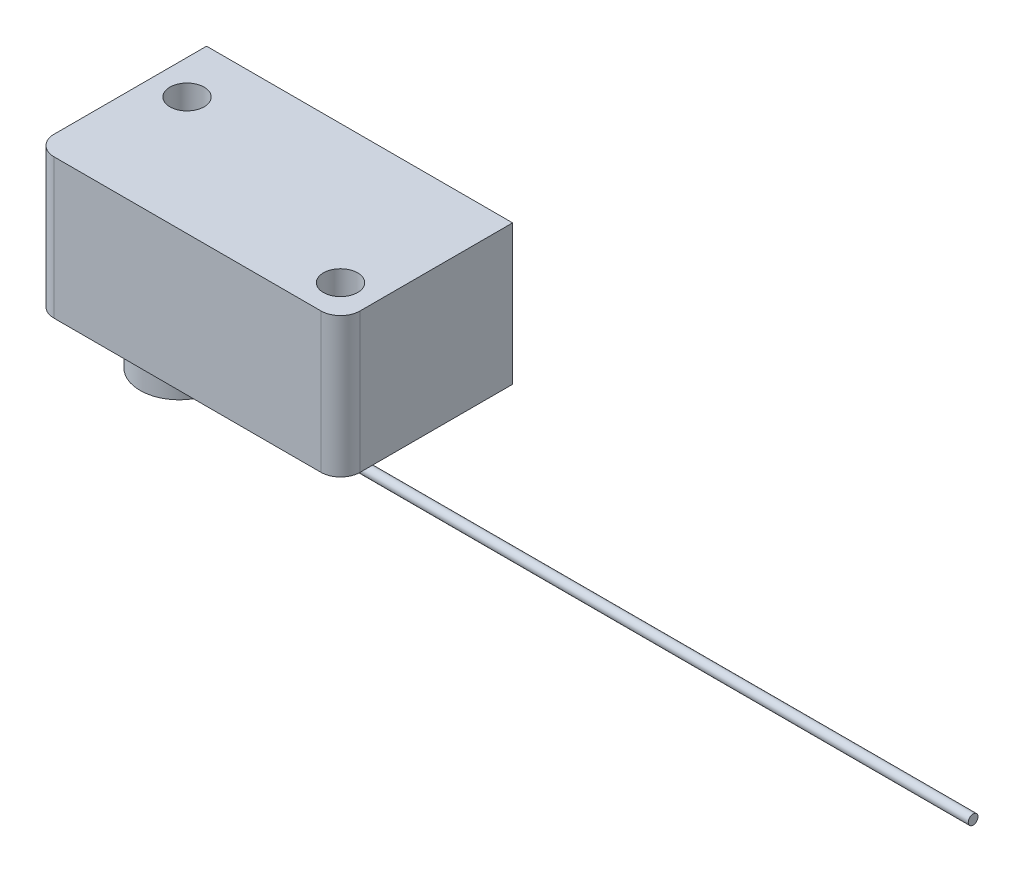
ISO-10303-21;
HEADER;
FILE_DESCRIPTION(('STEP AP214'),'2;1');
FILE_NAME('part.step','',(''),(''),'','','');
FILE_SCHEMA(('AUTOMOTIVE_DESIGN { 1 0 10303 214 1 1 1 1 }'));
ENDSEC;
DATA;
#1=APPLICATION_CONTEXT('core data for automotive mechanical design processes');
#2=APPLICATION_PROTOCOL_DEFINITION('international standard','automotive_design',2000,#1);
#3=PRODUCT_CONTEXT('',#1,'mechanical');
#4=PRODUCT('Part','Part','',(#3));
#5=PRODUCT_RELATED_PRODUCT_CATEGORY('part','',(#4));
#6=PRODUCT_DEFINITION_FORMATION('','',#4);
#7=PRODUCT_DEFINITION_CONTEXT('part definition',#1,'design');
#8=PRODUCT_DEFINITION('design','',#6,#7);
#9=PRODUCT_DEFINITION_SHAPE('','',#8);
#10=(LENGTH_UNIT() NAMED_UNIT(*) SI_UNIT(.MILLI.,.METRE.));
#11=(NAMED_UNIT(*) PLANE_ANGLE_UNIT() SI_UNIT($,.RADIAN.));
#12=(NAMED_UNIT(*) SI_UNIT($,.STERADIAN.) SOLID_ANGLE_UNIT());
#13=UNCERTAINTY_MEASURE_WITH_UNIT(LENGTH_MEASURE(1.E-05),#10,'distance_accuracy_value','');
#14=(GEOMETRIC_REPRESENTATION_CONTEXT(3) GLOBAL_UNCERTAINTY_ASSIGNED_CONTEXT((#13)) GLOBAL_UNIT_ASSIGNED_CONTEXT((#10,
#11,#12)) REPRESENTATION_CONTEXT('',''));
#15=CARTESIAN_POINT('',(0.,0.,0.));
#16=DIRECTION('',(0.,0.,1.));
#17=DIRECTION('',(1.,0.,0.));
#18=AXIS2_PLACEMENT_3D('',#15,#16,#17);
#19=CARTESIAN_POINT('',(31.3,14.3,-2.00000000000001));
#20=DIRECTION('',(-1.,0.,0.));
#21=DIRECTION('',(0.,0.,1.));
#22=AXIS2_PLACEMENT_3D('',#19,#20,#21);
#23=PLANE('',#22);
#24=DIRECTION('',(0.,0.,-1.));
#25=VECTOR('',#24,1.);
#26=CARTESIAN_POINT('',(31.3,0.,-2.00000000000001));
#27=LINE('',#26,#25);
#28=CARTESIAN_POINT('',(31.3,0.,-2.00000000000001));
#29=VERTEX_POINT('',#28);
#30=CARTESIAN_POINT('',(31.3,0.,-17.6));
#31=VERTEX_POINT('',#30);
#32=EDGE_CURVE('E122',#29,#31,#27,.T.);
#33=ORIENTED_EDGE('',*,*,#32,.T.);
#34=DIRECTION('',(0.,-1.,0.));
#35=VECTOR('',#34,1.);
#36=CARTESIAN_POINT('',(31.3,14.3,-17.6));
#37=LINE('',#36,#35);
#38=CARTESIAN_POINT('',(31.3,14.3,-17.6));
#39=VERTEX_POINT('',#38);
#40=EDGE_CURVE('E11',#39,#31,#37,.T.);
#41=ORIENTED_EDGE('',*,*,#40,.F.);
#42=DIRECTION('',(0.,0.,-1.));
#43=VECTOR('',#42,1.);
#44=CARTESIAN_POINT('',(31.3,14.3,-2.00000000000001));
#45=LINE('',#44,#43);
#46=CARTESIAN_POINT('',(31.3,14.3,-2.00000000000001));
#47=VERTEX_POINT('',#46);
#48=EDGE_CURVE('E133',#47,#39,#45,.T.);
#49=ORIENTED_EDGE('',*,*,#48,.F.);
#50=DIRECTION('',(0.,-1.,0.));
#51=VECTOR('',#50,1.);
#52=CARTESIAN_POINT('',(31.3,14.3,-2.00000000000001));
#53=LINE('',#52,#51);
#54=EDGE_CURVE('E118',#47,#29,#53,.T.);
#55=ORIENTED_EDGE('',*,*,#54,.T.);
#56=EDGE_LOOP('',(#33,#41,#49,#55));
#57=FACE_BOUND('',#56,.T.);
#58=ADVANCED_FACE('F33',(#57),#23,.F.);
#59=CARTESIAN_POINT('',(0.,14.3,-17.6));
#60=DIRECTION('',(0.,0.,1.));
#61=DIRECTION('',(1.,0.,0.));
#62=AXIS2_PLACEMENT_3D('',#59,#60,#61);
#63=PLANE('',#62);
#64=DIRECTION('',(-1.,0.,0.));
#65=VECTOR('',#64,1.);
#66=CARTESIAN_POINT('',(0.,0.,-17.6));
#67=LINE('',#66,#65);
#68=CARTESIAN_POINT('',(0.,0.,-17.6));
#69=VERTEX_POINT('',#68);
#70=EDGE_CURVE('E125',#31,#69,#67,.T.);
#71=ORIENTED_EDGE('',*,*,#70,.T.);
#72=DIRECTION('',(0.,-1.,0.));
#73=VECTOR('',#72,1.);
#74=CARTESIAN_POINT('',(0.,14.3,-17.6));
#75=LINE('',#74,#73);
#76=CARTESIAN_POINT('',(0.,14.3,-17.6));
#77=VERTEX_POINT('',#76);
#78=EDGE_CURVE('E46',#77,#69,#75,.T.);
#79=ORIENTED_EDGE('',*,*,#78,.F.);
#80=DIRECTION('',(-1.,0.,0.));
#81=VECTOR('',#80,1.);
#82=CARTESIAN_POINT('',(0.,14.3,-17.6));
#83=LINE('',#82,#81);
#84=EDGE_CURVE('E91',#39,#77,#83,.T.);
#85=ORIENTED_EDGE('',*,*,#84,.F.);
#86=ORIENTED_EDGE('',*,*,#40,.T.);
#87=EDGE_LOOP('',(#71,#79,#85,#86));
#88=FACE_BOUND('',#87,.T.);
#89=ADVANCED_FACE('F159',(#88),#63,.F.);
#90=CARTESIAN_POINT('',(0.,14.3,-2.00000000000001));
#91=DIRECTION('',(1.,0.,0.));
#92=DIRECTION('',(0.,0.,-1.));
#93=AXIS2_PLACEMENT_3D('',#90,#91,#92);
#94=PLANE('',#93);
#95=DIRECTION('',(0.,0.,1.));
#96=VECTOR('',#95,1.);
#97=CARTESIAN_POINT('',(0.,0.,-2.00000000000001));
#98=LINE('',#97,#96);
#99=CARTESIAN_POINT('',(0.,0.,-2.00000000000001));
#100=VERTEX_POINT('',#99);
#101=EDGE_CURVE('E128',#69,#100,#98,.T.);
#102=ORIENTED_EDGE('',*,*,#101,.T.);
#103=DIRECTION('',(0.,-1.,0.));
#104=VECTOR('',#103,1.);
#105=CARTESIAN_POINT('',(0.,14.3,-2.00000000000001));
#106=LINE('',#105,#104);
#107=CARTESIAN_POINT('',(0.,14.3,-2.00000000000001));
#108=VERTEX_POINT('',#107);
#109=EDGE_CURVE('E113',#108,#100,#106,.T.);
#110=ORIENTED_EDGE('',*,*,#109,.F.);
#111=DIRECTION('',(0.,0.,1.));
#112=VECTOR('',#111,1.);
#113=CARTESIAN_POINT('',(0.,14.3,-2.00000000000001));
#114=LINE('',#113,#112);
#115=EDGE_CURVE('E104',#77,#108,#114,.T.);
#116=ORIENTED_EDGE('',*,*,#115,.F.);
#117=ORIENTED_EDGE('',*,*,#78,.T.);
#118=EDGE_LOOP('',(#102,#110,#116,#117));
#119=FACE_BOUND('',#118,.T.);
#120=ADVANCED_FACE('F140',(#119),#94,.F.);
#121=CARTESIAN_POINT('',(2.,14.3,-2.));
#122=DIRECTION('',(0.,-1.,0.));
#123=DIRECTION('',(0.,0.,-1.));
#124=AXIS2_PLACEMENT_3D('',#121,#122,#123);
#125=CYLINDRICAL_SURFACE('',#124,2.);
#126=CARTESIAN_POINT('',(2.,0.,-2.));
#127=DIRECTION('',(0.,1.,0.));
#128=DIRECTION('',(0.,0.,-1.));
#129=AXIS2_PLACEMENT_3D('',#126,#127,#128);
#130=CIRCLE('',#129,2.);
#131=CARTESIAN_POINT('',(2.00000000000001,0.,0.));
#132=VERTEX_POINT('',#131);
#133=EDGE_CURVE('E112',#100,#132,#130,.T.);
#134=ORIENTED_EDGE('',*,*,#133,.T.);
#135=DIRECTION('',(0.,-1.,0.));
#136=VECTOR('',#135,1.);
#137=CARTESIAN_POINT('',(2.00000000000001,14.3,0.));
#138=LINE('',#137,#136);
#139=CARTESIAN_POINT('',(2.00000000000001,14.3,0.));
#140=VERTEX_POINT('',#139);
#141=EDGE_CURVE('E109',#140,#132,#138,.T.);
#142=ORIENTED_EDGE('',*,*,#141,.F.);
#143=CARTESIAN_POINT('',(2.,14.3,-2.));
#144=DIRECTION('',(0.,1.,0.));
#145=DIRECTION('',(0.,0.,-1.));
#146=AXIS2_PLACEMENT_3D('',#143,#144,#145);
#147=CIRCLE('',#146,2.);
#148=EDGE_CURVE('E98',#108,#140,#147,.T.);
#149=ORIENTED_EDGE('',*,*,#148,.F.);
#150=ORIENTED_EDGE('',*,*,#109,.T.);
#151=EDGE_LOOP('',(#134,#142,#149,#150));
#152=FACE_BOUND('',#151,.T.);
#153=ADVANCED_FACE('F110',(#152),#125,.T.);
#154=CARTESIAN_POINT('',(2.00000000000001,14.3,0.));
#155=DIRECTION('',(0.,0.,-1.));
#156=DIRECTION('',(-1.,0.,0.));
#157=AXIS2_PLACEMENT_3D('',#154,#155,#156);
#158=PLANE('',#157);
#159=DIRECTION('',(1.,0.,0.));
#160=VECTOR('',#159,1.);
#161=CARTESIAN_POINT('',(2.00000000000001,0.,0.));
#162=LINE('',#161,#160);
#163=CARTESIAN_POINT('',(29.3,0.,0.));
#164=VERTEX_POINT('',#163);
#165=EDGE_CURVE('E77',#132,#164,#162,.T.);
#166=ORIENTED_EDGE('',*,*,#165,.T.);
#167=DIRECTION('',(0.,-1.,0.));
#168=VECTOR('',#167,1.);
#169=CARTESIAN_POINT('',(29.3,14.3,0.));
#170=LINE('',#169,#168);
#171=CARTESIAN_POINT('',(29.3,14.3,0.));
#172=VERTEX_POINT('',#171);
#173=EDGE_CURVE('E114',#172,#164,#170,.T.);
#174=ORIENTED_EDGE('',*,*,#173,.F.);
#175=DIRECTION('',(1.,0.,0.));
#176=VECTOR('',#175,1.);
#177=CARTESIAN_POINT('',(2.00000000000001,14.3,0.));
#178=LINE('',#177,#176);
#179=EDGE_CURVE('E102',#140,#172,#178,.T.);
#180=ORIENTED_EDGE('',*,*,#179,.F.);
#181=ORIENTED_EDGE('',*,*,#141,.T.);
#182=EDGE_LOOP('',(#166,#174,#180,#181));
#183=FACE_BOUND('',#182,.T.);
#184=ADVANCED_FACE('F116',(#183),#158,.F.);
#185=CARTESIAN_POINT('',(29.3,14.3,-2.));
#186=DIRECTION('',(0.,-1.,0.));
#187=DIRECTION('',(0.,0.,-1.));
#188=AXIS2_PLACEMENT_3D('',#185,#186,#187);
#189=CYLINDRICAL_SURFACE('',#188,2.);
#190=CARTESIAN_POINT('',(29.3,0.,-2.));
#191=DIRECTION('',(0.,1.,0.));
#192=DIRECTION('',(0.,0.,1.));
#193=AXIS2_PLACEMENT_3D('',#190,#191,#192);
#194=CIRCLE('',#193,2.);
#195=EDGE_CURVE('E83',#164,#29,#194,.T.);
#196=ORIENTED_EDGE('',*,*,#195,.T.);
#197=ORIENTED_EDGE('',*,*,#54,.F.);
#198=CARTESIAN_POINT('',(29.3,14.3,-2.));
#199=DIRECTION('',(0.,1.,0.));
#200=DIRECTION('',(0.,0.,1.));
#201=AXIS2_PLACEMENT_3D('',#198,#199,#200);
#202=CIRCLE('',#201,2.);
#203=EDGE_CURVE('E54',#172,#47,#202,.T.);
#204=ORIENTED_EDGE('',*,*,#203,.F.);
#205=ORIENTED_EDGE('',*,*,#173,.T.);
#206=EDGE_LOOP('',(#196,#197,#204,#205));
#207=FACE_BOUND('',#206,.T.);
#208=ADVANCED_FACE('F147',(#207),#189,.T.);
#209=CARTESIAN_POINT('',(2.,14.3,-2.));
#210=DIRECTION('',(0.,-1.,0.));
#211=DIRECTION('',(0.,0.,-1.));
#212=AXIS2_PLACEMENT_3D('',#209,#210,#211);
#213=PLANE('',#212);
#214=CARTESIAN_POINT('',(27.8,14.3,-3.5));
#215=DIRECTION('',(0.,1.,0.));
#216=DIRECTION('',(0.,0.,1.));
#217=AXIS2_PLACEMENT_3D('',#214,#215,#216);
#218=CIRCLE('',#217,1.75);
#219=CARTESIAN_POINT('',(27.8,14.3,-1.75));
#220=VERTEX_POINT('',#219);
#221=EDGE_CURVE('E274',#220,#220,#218,.T.);
#222=ORIENTED_EDGE('',*,*,#221,.F.);
#223=EDGE_LOOP('',(#222));
#224=FACE_BOUND('',#223,.T.);
#225=CARTESIAN_POINT('',(3.5,14.3,-12.1));
#226=DIRECTION('',(0.,1.,0.));
#227=DIRECTION('',(0.,0.,1.));
#228=AXIS2_PLACEMENT_3D('',#225,#226,#227);
#229=CIRCLE('',#228,1.75);
#230=CARTESIAN_POINT('',(3.5,14.3,-10.35));
#231=VERTEX_POINT('',#230);
#232=EDGE_CURVE('E269',#231,#231,#229,.T.);
#233=ORIENTED_EDGE('',*,*,#232,.F.);
#234=EDGE_LOOP('',(#233));
#235=FACE_BOUND('',#234,.T.);
#236=ORIENTED_EDGE('',*,*,#48,.T.);
#237=ORIENTED_EDGE('',*,*,#84,.T.);
#238=ORIENTED_EDGE('',*,*,#115,.T.);
#239=ORIENTED_EDGE('',*,*,#148,.T.);
#240=ORIENTED_EDGE('',*,*,#179,.T.);
#241=ORIENTED_EDGE('',*,*,#203,.T.);
#242=EDGE_LOOP('',(#236,#237,#238,#239,#240,#241));
#243=FACE_BOUND('',#242,.T.);
#244=ADVANCED_FACE('F100',(#224,#235,#243),#213,.F.);
#245=CARTESIAN_POINT('',(2.,0.,-2.));
#246=DIRECTION('',(0.,-1.,0.));
#247=DIRECTION('',(0.,0.,-1.));
#248=AXIS2_PLACEMENT_3D('',#245,#246,#247);
#249=PLANE('',#248);
#250=CARTESIAN_POINT('',(8.8,0.,-6.));
#251=DIRECTION('',(0.,-1.,0.));
#252=DIRECTION('',(0.,0.,-1.));
#253=AXIS2_PLACEMENT_3D('',#250,#251,#252);
#254=CIRCLE('',#253,4.);
#255=CARTESIAN_POINT('',(8.8,0.,-10.));
#256=VERTEX_POINT('',#255);
#257=EDGE_CURVE('E264',#256,#256,#254,.T.);
#258=ORIENTED_EDGE('',*,*,#257,.F.);
#259=EDGE_LOOP('',(#258));
#260=FACE_BOUND('',#259,.T.);
#261=CARTESIAN_POINT('',(27.8,0.,-3.5));
#262=DIRECTION('',(0.,1.,0.));
#263=DIRECTION('',(0.,0.,1.));
#264=AXIS2_PLACEMENT_3D('',#261,#262,#263);
#265=CIRCLE('',#264,1.75);
#266=CARTESIAN_POINT('',(27.8,0.,-1.75));
#267=VERTEX_POINT('',#266);
#268=EDGE_CURVE('E126',#267,#267,#265,.T.);
#269=ORIENTED_EDGE('',*,*,#268,.T.);
#270=EDGE_LOOP('',(#269));
#271=FACE_BOUND('',#270,.T.);
#272=CARTESIAN_POINT('',(3.5,0.,-12.1));
#273=DIRECTION('',(0.,1.,0.));
#274=DIRECTION('',(0.,0.,1.));
#275=AXIS2_PLACEMENT_3D('',#272,#273,#274);
#276=CIRCLE('',#275,1.75);
#277=CARTESIAN_POINT('',(3.5,0.,-10.35));
#278=VERTEX_POINT('',#277);
#279=EDGE_CURVE('E277',#278,#278,#276,.T.);
#280=ORIENTED_EDGE('',*,*,#279,.T.);
#281=EDGE_LOOP('',(#280));
#282=FACE_BOUND('',#281,.T.);
#283=ORIENTED_EDGE('',*,*,#32,.F.);
#284=ORIENTED_EDGE('',*,*,#195,.F.);
#285=ORIENTED_EDGE('',*,*,#165,.F.);
#286=ORIENTED_EDGE('',*,*,#133,.F.);
#287=ORIENTED_EDGE('',*,*,#101,.F.);
#288=ORIENTED_EDGE('',*,*,#70,.F.);
#289=EDGE_LOOP('',(#283,#284,#285,#286,#287,#288));
#290=FACE_BOUND('',#289,.T.);
#291=ADVANCED_FACE('F143',(#260,#271,#282,#290),#249,.T.);
#292=CARTESIAN_POINT('',(3.5,0.,-12.1));
#293=DIRECTION('',(0.,1.,0.));
#294=DIRECTION('',(0.,0.,1.));
#295=AXIS2_PLACEMENT_3D('',#292,#293,#294);
#296=CYLINDRICAL_SURFACE('',#295,1.75);
#297=ORIENTED_EDGE('',*,*,#279,.F.);
#298=EDGE_LOOP('',(#297));
#299=FACE_BOUND('',#298,.T.);
#300=ORIENTED_EDGE('',*,*,#232,.T.);
#301=EDGE_LOOP('',(#300));
#302=FACE_BOUND('',#301,.T.);
#303=ADVANCED_FACE('F194',(#299,#302),#296,.F.);
#304=CARTESIAN_POINT('',(27.8,0.,-3.5));
#305=DIRECTION('',(0.,1.,0.));
#306=DIRECTION('',(0.,0.,1.));
#307=AXIS2_PLACEMENT_3D('',#304,#305,#306);
#308=CYLINDRICAL_SURFACE('',#307,1.75);
#309=ORIENTED_EDGE('',*,*,#268,.F.);
#310=EDGE_LOOP('',(#309));
#311=FACE_BOUND('',#310,.T.);
#312=ORIENTED_EDGE('',*,*,#221,.T.);
#313=EDGE_LOOP('',(#312));
#314=FACE_BOUND('',#313,.T.);
#315=ADVANCED_FACE('F199',(#311,#314),#308,.F.);
#316=CARTESIAN_POINT('',(8.8,-4.,-6.));
#317=DIRECTION('',(0.,1.,0.));
#318=DIRECTION('',(0.,0.,1.));
#319=AXIS2_PLACEMENT_3D('',#316,#317,#318);
#320=CYLINDRICAL_SURFACE('',#319,4.);
#321=CARTESIAN_POINT('',(12.7686269665969,-3.4,-5.5));
#322=CARTESIAN_POINT('',(12.7686273683427,-3.37203274324163,-5.50000118903321));
#323=CARTESIAN_POINT('',(12.7689257902379,-3.34404800701904,-5.50235442019574));
#324=CARTESIAN_POINT('',(12.7700867819599,-3.28885735491908,-5.51170471725573));
#325=CARTESIAN_POINT('',(12.7709499412859,-3.26165228390059,-5.51870663578174));
#326=CARTESIAN_POINT('',(12.7731411475509,-3.20882802357679,-5.53714466143481));
#327=CARTESIAN_POINT('',(12.7744688789073,-3.18320777157627,-5.54857775904035));
#328=CARTESIAN_POINT('',(12.7774392470398,-3.13425430963538,-5.57554716031409));
#329=CARTESIAN_POINT('',(12.7790818299686,-3.11092070965139,-5.59108276252504));
#330=CARTESIAN_POINT('',(12.7825071184878,-3.06706755057557,-5.62590930994712));
#331=CARTESIAN_POINT('',(12.7842904834041,-3.04656263953622,-5.64521863699514));
#332=CARTESIAN_POINT('',(12.7877904657517,-3.00907544621218,-5.68700494786575));
#333=CARTESIAN_POINT('',(12.7895070798588,-2.99209333918106,-5.70948208918839));
#334=CARTESIAN_POINT('',(12.7926868892256,-2.96208128409873,-5.75705803386481));
#335=CARTESIAN_POINT('',(12.7941492276936,-2.94906459098007,-5.78216526088778));
#336=CARTESIAN_POINT('',(12.7966484739091,-2.92743776001181,-5.83423065638882));
#337=CARTESIAN_POINT('',(12.7976853974459,-2.9188274586147,-5.86118875612782));
#338=CARTESIAN_POINT('',(12.7992123374125,-2.90630158633311,-5.91604086244978));
#339=CARTESIAN_POINT('',(12.7997051896719,-2.90236166429522,-5.94392922806732));
#340=CARTESIAN_POINT('',(12.8000981394584,-2.89921292299269,-5.99997535986269));
#341=CARTESIAN_POINT('',(12.7999982603042,-2.90000391760949,-6.02813311539895));
#342=CARTESIAN_POINT('',(12.79921929554,-2.90627504055149,-6.08375305379491));
#343=CARTESIAN_POINT('',(12.7985434449115,-2.91172897969628,-6.11121824115289));
#344=CARTESIAN_POINT('',(12.7966921118847,-2.92713023532599,-6.16484043278108));
#345=CARTESIAN_POINT('',(12.7955166199881,-2.93707763723337,-6.19099741217124));
#346=CARTESIAN_POINT('',(12.7927925156158,-2.96121129855676,-6.24134176308773));
#347=CARTESIAN_POINT('',(12.7912429076865,-2.97540889154604,-6.26552364556811));
#348=CARTESIAN_POINT('',(12.7879439381306,-3.00763167244321,-6.3111714904613));
#349=CARTESIAN_POINT('',(12.7861945673445,-3.02565703589371,-6.33263732824347));
#350=CARTESIAN_POINT('',(12.782677735047,-3.06517036371968,-6.37239760615459));
#351=CARTESIAN_POINT('',(12.7809102316095,-3.08668115190933,-6.3906693679992));
#352=CARTESIAN_POINT('',(12.7775681438812,-3.13247631135649,-6.42334657012502));
#353=CARTESIAN_POINT('',(12.7759935601952,-3.15676069130761,-6.43775199828702));
#354=CARTESIAN_POINT('',(12.7732156052254,-3.20743389911247,-6.46228891471655));
#355=CARTESIAN_POINT('',(12.7720123918163,-3.23382361599064,-6.47241858597247));
#356=CARTESIAN_POINT('',(12.7701164849919,-3.28794789070537,-6.48809633089362));
#357=CARTESIAN_POINT('',(12.7694237669734,-3.31568238366174,-6.49364462535993));
#358=CARTESIAN_POINT('',(12.7686317775681,-3.37150863639995,-6.49997208638172));
#359=CARTESIAN_POINT('',(12.7685285348848,-3.39959672461776,-6.50078316839966));
#360=CARTESIAN_POINT('',(12.7689166822393,-3.45550838593308,-6.49769739064611));
#361=CARTESIAN_POINT('',(12.7694080596029,-3.48333196465586,-6.49380063122196));
#362=CARTESIAN_POINT('',(12.770926456968,-3.53782915271557,-6.48143665715955));
#363=CARTESIAN_POINT('',(12.7719516653893,-3.56450632303808,-6.47298489674921));
#364=CARTESIAN_POINT('',(12.7744207399416,-3.61606483097063,-6.45176674382323));
#365=CARTESIAN_POINT('',(12.7758646207815,-3.64094610544817,-6.43900019971625));
#366=CARTESIAN_POINT('',(12.7790178627065,-3.6883509287626,-6.40943640443099));
#367=CARTESIAN_POINT('',(12.7807285854742,-3.71086133306289,-6.39261822391542));
#368=CARTESIAN_POINT('',(12.784218479102,-3.75275131078701,-6.35545814847379));
#369=CARTESIAN_POINT('',(12.7859976526226,-3.7721307623736,-6.3351161164851));
#370=CARTESIAN_POINT('',(12.7894361773739,-3.80732083746688,-6.2913463551117));
#371=CARTESIAN_POINT('',(12.791094787825,-3.823110489359,-6.26790169842341));
#372=CARTESIAN_POINT('',(12.7940942260632,-3.85052764352676,-6.21867451633636));
#373=CARTESIAN_POINT('',(12.7954350602554,-3.8621552296962,-6.19289203807366));
#374=CARTESIAN_POINT('',(12.7976445813064,-3.88088355738161,-6.13979077182789));
#375=CARTESIAN_POINT('',(12.7985145313754,-3.88799641920632,-6.11247631330236));
#376=CARTESIAN_POINT('',(12.7996895093551,-3.89753281784535,-6.05702921145559));
#377=CARTESIAN_POINT('',(12.7999945627404,-3.89995656611985,-6.02889660508762));
#378=CARTESIAN_POINT('',(12.8000052560273,-3.90004198445843,-5.97281656333124));
#379=CARTESIAN_POINT('',(12.7997149663357,-3.8977359921136,-5.94486917245705));
#380=CARTESIAN_POINT('',(12.7985756823159,-3.88849587731383,-5.88976245170948));
#381=CARTESIAN_POINT('',(12.7977266883763,-3.88156175807765,-5.86260312128803));
#382=CARTESIAN_POINT('',(12.7955649704241,-3.86327237713006,-5.80984771140254));
#383=CARTESIAN_POINT('',(12.7942524088689,-3.85191866412536,-5.78425108796808));
#384=CARTESIAN_POINT('',(12.7913088952126,-3.82511573707849,-5.73532133257119));
#385=CARTESIAN_POINT('',(12.7896779393262,-3.80966647434766,-5.71198822752239));
#386=CARTESIAN_POINT('',(12.7862663878512,-3.77499135693272,-5.66808264640749));
#387=CARTESIAN_POINT('',(12.7844848825578,-3.75574144129527,-5.64752924243314));
#388=CARTESIAN_POINT('',(12.7809803180271,-3.71406141119423,-5.60993177623613));
#389=CARTESIAN_POINT('',(12.779257272734,-3.69163054450182,-5.5928885464413));
#390=CARTESIAN_POINT('',(12.7760576227894,-3.64412601546053,-5.56273895149679));
#391=CARTESIAN_POINT('',(12.7745819955046,-3.61904248201298,-5.54964804336665));
#392=CARTESIAN_POINT('',(12.7720557162392,-3.56702865188105,-5.52788294233133));
#393=CARTESIAN_POINT('',(12.7710046023078,-3.54010040013932,-5.51920394575434));
#394=CARTESIAN_POINT('',(12.7697015736397,-3.49419400259129,-5.5085868207524));
#395=CARTESIAN_POINT('',(12.7693006030438,-3.47550540969249,-5.50537139379788));
#396=CARTESIAN_POINT('',(12.7687631644598,-3.43788055000661,-5.5010775888189));
#397=CARTESIAN_POINT('',(12.7686266944649,-3.41894428509981,-5.49999919458014));
#398=CARTESIAN_POINT('',(12.7686269665969,-3.4,-5.5));
#399=B_SPLINE_CURVE_WITH_KNOTS('',3,(#321,#322,#323,#324,#325,#326,#327,#328,#329,#330,#331,
#332,#333,#334,#335,#336,#337,#338,#339,#340,#341,#342,#343,#344,#345,#346,#347,#348,#349,#350,
#351,#352,#353,#354,#355,#356,#357,#358,#359,#360,#361,#362,#363,#364,#365,#366,#367,#368,#369,
#370,#371,#372,#373,#374,#375,#376,#377,#378,#379,#380,#381,#382,#383,#384,#385,#386,#387,#388,
#389,#390,#391,#392,#393,#394,#395,#396,#397,#398),.UNSPECIFIED.,.T.,.F.,(4,2,2,2,2,2,2,2,2,2,2,
2,2,2,2,2,2,2,2,2,2,2,2,2,2,2,2,2,2,2,2,2,2,2,2,2,2,2,4),(0.,0.083832563495848,
0.167752775230477,0.251616090516241,0.335465075901226,0.419733155098132,0.50400542548516,
0.588556372291484,0.673104180679662,0.757209193882917,0.841310898340219,0.924943329866079,
1.00857735134358,1.09243640882561,1.17629931293821,1.26073539475554,1.34517174123885,
1.42964393347802,1.51411205431238,1.59801043561177,1.68190702865423,1.76552075258547,
1.84913741442371,1.93319563908823,2.01725713398963,2.10179777178469,2.18633670541776,
2.27064771356988,2.35495491954563,2.43868763257651,2.52242028737358,2.60612362708818,
2.6898279619285,2.77408025778168,2.85835251087966,2.94295019540967,3.02745557196404,
3.0842419792659,3.14102795571095),.UNSPECIFIED.);
#400=CARTESIAN_POINT('',(12.7686269665969,-3.4,-5.5));
#401=VERTEX_POINT('',#400);
#402=EDGE_CURVE('E36',#401,#401,#399,.T.);
#403=ORIENTED_EDGE('',*,*,#402,.T.);
#404=EDGE_LOOP('',(#403));
#405=FACE_BOUND('',#404,.T.);
#406=CARTESIAN_POINT('',(8.8,-4.,-6.));
#407=DIRECTION('',(0.,-1.,0.));
#408=DIRECTION('',(0.,0.,-1.));
#409=AXIS2_PLACEMENT_3D('',#406,#407,#408);
#410=CIRCLE('',#409,4.);
#411=CARTESIAN_POINT('',(8.8,-4.,-10.));
#412=VERTEX_POINT('',#411);
#413=EDGE_CURVE('E266',#412,#412,#410,.T.);
#414=ORIENTED_EDGE('',*,*,#413,.F.);
#415=EDGE_LOOP('',(#414));
#416=FACE_BOUND('',#415,.T.);
#417=ORIENTED_EDGE('',*,*,#257,.T.);
#418=EDGE_LOOP('',(#417));
#419=FACE_BOUND('',#418,.T.);
#420=ADVANCED_FACE('F209',(#405,#416,#419),#320,.T.);
#421=CARTESIAN_POINT('',(8.8,-4.,-6.));
#422=DIRECTION('',(0.,-1.,0.));
#423=DIRECTION('',(0.,0.,-1.));
#424=AXIS2_PLACEMENT_3D('',#421,#422,#423);
#425=PLANE('',#424);
#426=ORIENTED_EDGE('',*,*,#413,.T.);
#427=EDGE_LOOP('',(#426));
#428=FACE_BOUND('',#427,.T.);
#429=ADVANCED_FACE('F223',(#428),#425,.T.);
#430=CARTESIAN_POINT('',(90.,-3.4,-6.));
#431=DIRECTION('',(-1.,0.,0.));
#432=DIRECTION('',(0.,0.,1.));
#433=AXIS2_PLACEMENT_3D('',#430,#431,#432);
#434=CYLINDRICAL_SURFACE('',#433,0.500000000000001);
#435=CARTESIAN_POINT('',(90.,-3.4,-6.));
#436=DIRECTION('',(-1.,0.,0.));
#437=DIRECTION('',(0.,0.,1.));
#438=AXIS2_PLACEMENT_3D('',#435,#436,#437);
#439=CIRCLE('',#438,0.500000000000001);
#440=CARTESIAN_POINT('',(90.,-3.4,-5.5));
#441=VERTEX_POINT('',#440);
#442=EDGE_CURVE('E261',#441,#441,#439,.T.);
#443=ORIENTED_EDGE('',*,*,#442,.T.);
#444=EDGE_LOOP('',(#443));
#445=FACE_BOUND('',#444,.T.);
#446=ORIENTED_EDGE('',*,*,#402,.F.);
#447=EDGE_LOOP('',(#446));
#448=FACE_BOUND('',#447,.T.);
#449=ADVANCED_FACE('F228',(#445,#448),#434,.T.);
#450=CARTESIAN_POINT('',(90.,-3.4,-6.));
#451=DIRECTION('',(-1.,0.,0.));
#452=DIRECTION('',(0.,0.,1.));
#453=AXIS2_PLACEMENT_3D('',#450,#451,#452);
#454=PLANE('',#453);
#455=ORIENTED_EDGE('',*,*,#442,.F.);
#456=EDGE_LOOP('',(#455));
#457=FACE_BOUND('',#456,.T.);
#458=ADVANCED_FACE('F244',(#457),#454,.F.);
#459=CLOSED_SHELL('',(#58,#89,#120,#153,#184,#208,#244,#291,#303,#315,#420,#429,#449,#458));
#460=MANIFOLD_SOLID_BREP('B2',#459);
#461=ADVANCED_BREP_SHAPE_REPRESENTATION('',(#18,#460),#14);
#462=SHAPE_DEFINITION_REPRESENTATION(#9,#461);
ENDSEC;
END-ISO-10303-21;
